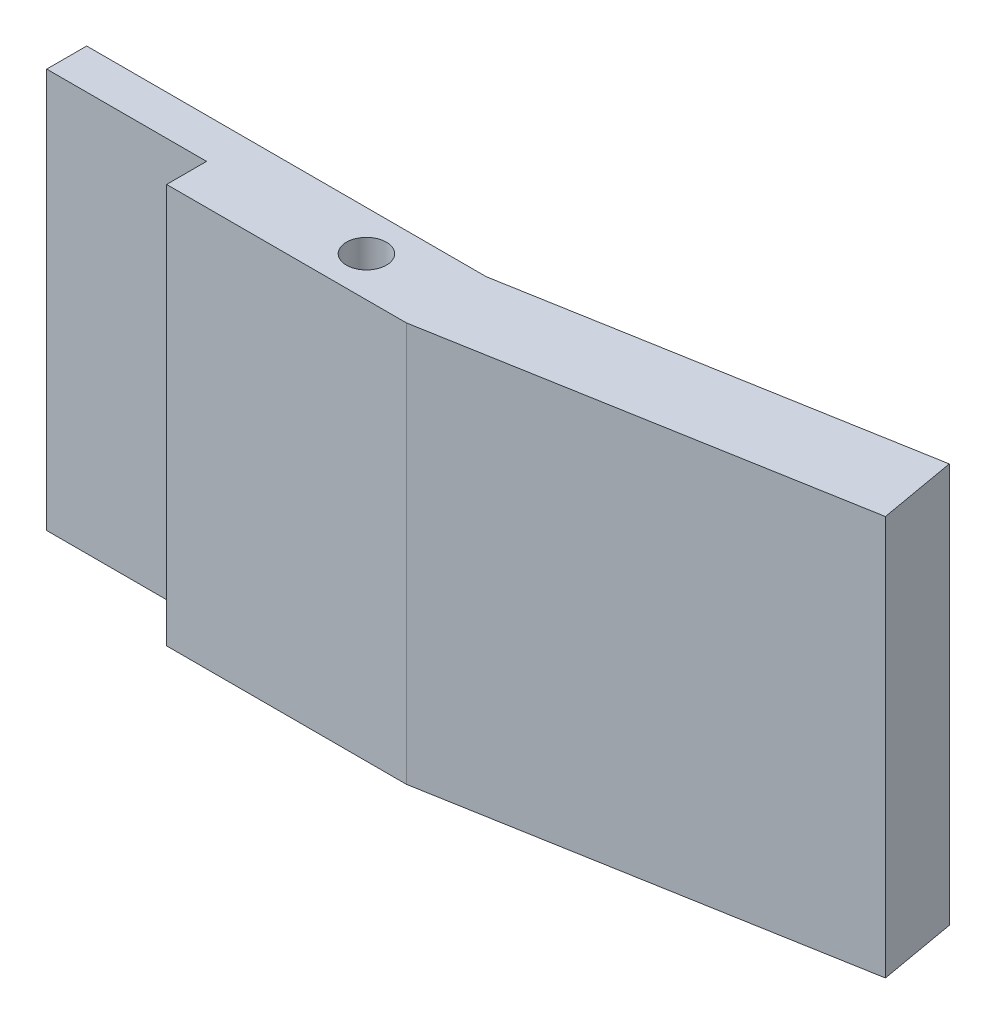
ISO-10303-21;
HEADER;
FILE_DESCRIPTION(('STEP AP214'),'2;1');
FILE_NAME('part.step','',(''),(''),'','','');
FILE_SCHEMA(('AUTOMOTIVE_DESIGN { 1 0 10303 214 1 1 1 1 }'));
ENDSEC;
DATA;
#1=APPLICATION_CONTEXT('core data for automotive mechanical design processes');
#2=APPLICATION_PROTOCOL_DEFINITION('international standard','automotive_design',2000,#1);
#3=PRODUCT_CONTEXT('',#1,'mechanical');
#4=PRODUCT('Part','Part','',(#3));
#5=PRODUCT_RELATED_PRODUCT_CATEGORY('part','',(#4));
#6=PRODUCT_DEFINITION_FORMATION('','',#4);
#7=PRODUCT_DEFINITION_CONTEXT('part definition',#1,'design');
#8=PRODUCT_DEFINITION('design','',#6,#7);
#9=PRODUCT_DEFINITION_SHAPE('','',#8);
#10=(LENGTH_UNIT() NAMED_UNIT(*) SI_UNIT(.MILLI.,.METRE.));
#11=(NAMED_UNIT(*) PLANE_ANGLE_UNIT() SI_UNIT($,.RADIAN.));
#12=(NAMED_UNIT(*) SI_UNIT($,.STERADIAN.) SOLID_ANGLE_UNIT());
#13=UNCERTAINTY_MEASURE_WITH_UNIT(LENGTH_MEASURE(1.E-05),#10,'distance_accuracy_value','');
#14=(GEOMETRIC_REPRESENTATION_CONTEXT(3) GLOBAL_UNCERTAINTY_ASSIGNED_CONTEXT((#13)) GLOBAL_UNIT_ASSIGNED_CONTEXT((#10,
#11,#12)) REPRESENTATION_CONTEXT('',''));
#15=CARTESIAN_POINT('',(0.,0.,0.));
#16=DIRECTION('',(0.,0.,1.));
#17=DIRECTION('',(1.,0.,0.));
#18=AXIS2_PLACEMENT_3D('',#15,#16,#17);
#19=CARTESIAN_POINT('',(25.4,31.75,3.175));
#20=DIRECTION('',(0.,-1.,0.));
#21=DIRECTION('',(0.,0.,-1.));
#22=AXIS2_PLACEMENT_3D('',#19,#20,#21);
#23=CYLINDRICAL_SURFACE('',#22,1.5875);
#24=CARTESIAN_POINT('',(25.4,31.75,3.175));
#25=DIRECTION('',(0.,1.,0.));
#26=DIRECTION('',(0.,0.,1.));
#27=AXIS2_PLACEMENT_3D('',#24,#25,#26);
#28=CIRCLE('',#27,1.5875);
#29=CARTESIAN_POINT('',(25.4,31.75,4.7625));
#30=VERTEX_POINT('',#29);
#31=EDGE_CURVE('E142',#30,#30,#28,.T.);
#32=ORIENTED_EDGE('',*,*,#31,.T.);
#33=EDGE_LOOP('',(#32));
#34=FACE_BOUND('',#33,.T.);
#35=CARTESIAN_POINT('',(25.4,0.,3.175));
#36=DIRECTION('',(0.,1.,0.));
#37=DIRECTION('',(0.,0.,1.));
#38=AXIS2_PLACEMENT_3D('',#35,#36,#37);
#39=CIRCLE('',#38,1.5875);
#40=CARTESIAN_POINT('',(25.4,0.,4.7625));
#41=VERTEX_POINT('',#40);
#42=EDGE_CURVE('E143',#41,#41,#39,.T.);
#43=ORIENTED_EDGE('',*,*,#42,.F.);
#44=EDGE_LOOP('',(#43));
#45=FACE_BOUND('',#44,.T.);
#46=ADVANCED_FACE('F45',(#34,#45),#23,.F.);
#47=CARTESIAN_POINT('',(62.060266513114,31.75,-10.9428994162196));
#48=DIRECTION('',(0.984807753012209,0.,-0.173648177666923));
#49=DIRECTION('',(-0.173648177666923,0.,-0.984807753012209));
#50=AXIS2_PLACEMENT_3D('',#47,#48,#49);
#51=PLANE('',#50);
#52=DIRECTION('',(0.173648177666923,0.,0.984807753012209));
#53=VECTOR('',#52,1.);
#54=CARTESIAN_POINT('',(62.060266513114,0.,-10.9428994162196));
#55=LINE('',#54,#53);
#56=CARTESIAN_POINT('',(63.0176461581377,0.,-5.51332964092484));
#57=VERTEX_POINT('',#56);
#58=CARTESIAN_POINT('',(64.1035601131966,0.,0.645194430070445));
#59=VERTEX_POINT('',#58);
#60=EDGE_CURVE('E157',#57,#59,#55,.T.);
#61=ORIENTED_EDGE('',*,*,#60,.F.);
#62=DIRECTION('',(0.,-1.,0.));
#63=VECTOR('',#62,1.);
#64=CARTESIAN_POINT('',(63.0176461581377,31.75,-5.51332964092484));
#65=LINE('',#64,#63);
#66=CARTESIAN_POINT('',(63.0176461581377,31.75,-5.51332964092484));
#67=VERTEX_POINT('',#66);
#68=EDGE_CURVE('E128',#67,#57,#65,.T.);
#69=ORIENTED_EDGE('',*,*,#68,.F.);
#70=DIRECTION('',(0.173648177666923,0.,0.984807753012209));
#71=VECTOR('',#70,1.);
#72=CARTESIAN_POINT('',(62.060266513114,31.75,-10.9428994162196));
#73=LINE('',#72,#71);
#74=CARTESIAN_POINT('',(64.1035601131966,31.75,0.645194430070445));
#75=VERTEX_POINT('',#74);
#76=EDGE_CURVE('E181',#67,#75,#73,.T.);
#77=ORIENTED_EDGE('',*,*,#76,.T.);
#78=DIRECTION('',(0.,-1.,0.));
#79=VECTOR('',#78,1.);
#80=CARTESIAN_POINT('',(64.1035601131966,31.75,0.645194430070445));
#81=LINE('',#80,#79);
#82=EDGE_CURVE('E55',#75,#59,#81,.T.);
#83=ORIENTED_EDGE('',*,*,#82,.T.);
#84=EDGE_LOOP('',(#61,#69,#77,#83));
#85=FACE_BOUND('',#84,.T.);
#86=ADVANCED_FACE('F207',(#85),#51,.T.);
#87=CARTESIAN_POINT('',(2.04329360008259,31.75,11.5880938462901));
#88=DIRECTION('',(0.173648177666924,0.,0.984807753012209));
#89=DIRECTION('',(0.984807753012209,0.,-0.173648177666924));
#90=AXIS2_PLACEMENT_3D('',#87,#88,#89);
#91=PLANE('',#90);
#92=DIRECTION('',(-0.984807753012209,0.,0.173648177666924));
#93=VECTOR('',#92,1.);
#94=CARTESIAN_POINT('',(2.04329360008259,0.,11.5880938462901));
#95=LINE('',#94,#93);
#96=CARTESIAN_POINT('',(31.75,0.,6.35));
#97=VERTEX_POINT('',#96);
#98=EDGE_CURVE('E104',#59,#97,#95,.T.);
#99=ORIENTED_EDGE('',*,*,#98,.F.);
#100=ORIENTED_EDGE('',*,*,#82,.F.);
#101=DIRECTION('',(-0.984807753012209,0.,0.173648177666924));
#102=VECTOR('',#101,1.);
#103=CARTESIAN_POINT('',(2.04329360008259,31.75,11.5880938462901));
#104=LINE('',#103,#102);
#105=CARTESIAN_POINT('',(31.75,31.75,6.35));
#106=VERTEX_POINT('',#105);
#107=EDGE_CURVE('E147',#75,#106,#104,.T.);
#108=ORIENTED_EDGE('',*,*,#107,.T.);
#109=DIRECTION('',(0.,-1.,0.));
#110=VECTOR('',#109,1.);
#111=CARTESIAN_POINT('',(31.75,31.75,6.35));
#112=LINE('',#111,#110);
#113=EDGE_CURVE('E138',#106,#97,#112,.T.);
#114=ORIENTED_EDGE('',*,*,#113,.T.);
#115=EDGE_LOOP('',(#99,#100,#108,#114));
#116=FACE_BOUND('',#115,.T.);
#117=ADVANCED_FACE('F191',(#116),#91,.T.);
#118=CARTESIAN_POINT('',(0.957379645023635,31.75,5.4295697752948));
#119=DIRECTION('',(-0.173648177666924,0.,-0.984807753012209));
#120=DIRECTION('',(-0.984807753012209,0.,0.173648177666924));
#121=AXIS2_PLACEMENT_3D('',#118,#119,#120);
#122=PLANE('',#121);
#123=DIRECTION('',(0.984807753012209,0.,-0.173648177666924));
#124=VECTOR('',#123,1.);
#125=CARTESIAN_POINT('',(0.957379645023635,0.,5.4295697752948));
#126=LINE('',#125,#124);
#127=CARTESIAN_POINT('',(31.75,0.,0.));
#128=VERTEX_POINT('',#127);
#129=EDGE_CURVE('E99',#128,#57,#126,.T.);
#130=ORIENTED_EDGE('',*,*,#129,.F.);
#131=DIRECTION('',(0.,-1.,0.));
#132=VECTOR('',#131,1.);
#133=CARTESIAN_POINT('',(31.75,31.75,0.));
#134=LINE('',#133,#132);
#135=CARTESIAN_POINT('',(31.75,31.75,0.));
#136=VERTEX_POINT('',#135);
#137=EDGE_CURVE('E93',#136,#128,#134,.T.);
#138=ORIENTED_EDGE('',*,*,#137,.F.);
#139=DIRECTION('',(0.984807753012209,0.,-0.173648177666924));
#140=VECTOR('',#139,1.);
#141=CARTESIAN_POINT('',(0.957379645023635,31.75,5.4295697752948));
#142=LINE('',#141,#140);
#143=EDGE_CURVE('E177',#136,#67,#142,.T.);
#144=ORIENTED_EDGE('',*,*,#143,.T.);
#145=ORIENTED_EDGE('',*,*,#68,.T.);
#146=EDGE_LOOP('',(#130,#138,#144,#145));
#147=FACE_BOUND('',#146,.T.);
#148=ADVANCED_FACE('F212',(#147),#122,.T.);
#149=CARTESIAN_POINT('',(0.,31.75,6.35));
#150=DIRECTION('',(0.,0.,-1.));
#151=DIRECTION('',(-1.,0.,0.));
#152=AXIS2_PLACEMENT_3D('',#149,#150,#151);
#153=PLANE('',#152);
#154=DIRECTION('',(1.,0.,0.));
#155=VECTOR('',#154,1.);
#156=CARTESIAN_POINT('',(0.,0.,6.35));
#157=LINE('',#156,#155);
#158=CARTESIAN_POINT('',(12.7,0.,6.35));
#159=VERTEX_POINT('',#158);
#160=EDGE_CURVE('E148',#159,#97,#157,.T.);
#161=ORIENTED_EDGE('',*,*,#160,.T.);
#162=ORIENTED_EDGE('',*,*,#113,.F.);
#163=DIRECTION('',(1.,0.,0.));
#164=VECTOR('',#163,1.);
#165=CARTESIAN_POINT('',(0.,31.75,6.35));
#166=LINE('',#165,#164);
#167=CARTESIAN_POINT('',(12.7,31.75,6.35));
#168=VERTEX_POINT('',#167);
#169=EDGE_CURVE('E166',#168,#106,#166,.T.);
#170=ORIENTED_EDGE('',*,*,#169,.F.);
#171=DIRECTION('',(0.,-1.,0.));
#172=VECTOR('',#171,1.);
#173=CARTESIAN_POINT('',(12.7,31.75,6.35));
#174=LINE('',#173,#172);
#175=EDGE_CURVE('E134',#168,#159,#174,.T.);
#176=ORIENTED_EDGE('',*,*,#175,.T.);
#177=EDGE_LOOP('',(#161,#162,#170,#176));
#178=FACE_BOUND('',#177,.T.);
#179=ADVANCED_FACE('F224',(#178),#153,.F.);
#180=CARTESIAN_POINT('',(0.,0.,0.));
#181=DIRECTION('',(0.,1.,0.));
#182=DIRECTION('',(0.,0.,1.));
#183=AXIS2_PLACEMENT_3D('',#180,#181,#182);
#184=PLANE('',#183);
#185=ORIENTED_EDGE('',*,*,#98,.T.);
#186=ORIENTED_EDGE('',*,*,#160,.F.);
#187=DIRECTION('',(0.,0.,1.));
#188=VECTOR('',#187,1.);
#189=CARTESIAN_POINT('',(12.7,0.,0.));
#190=LINE('',#189,#188);
#191=CARTESIAN_POINT('',(12.7,0.,3.175));
#192=VERTEX_POINT('',#191);
#193=EDGE_CURVE('E98',#192,#159,#190,.T.);
#194=ORIENTED_EDGE('',*,*,#193,.F.);
#195=DIRECTION('',(1.,0.,0.));
#196=VECTOR('',#195,1.);
#197=CARTESIAN_POINT('',(0.,0.,3.175));
#198=LINE('',#197,#196);
#199=CARTESIAN_POINT('',(0.,0.,3.175));
#200=VERTEX_POINT('',#199);
#201=EDGE_CURVE('E112',#200,#192,#198,.T.);
#202=ORIENTED_EDGE('',*,*,#201,.F.);
#203=DIRECTION('',(0.,0.,1.));
#204=VECTOR('',#203,1.);
#205=CARTESIAN_POINT('',(0.,0.,0.));
#206=LINE('',#205,#204);
#207=CARTESIAN_POINT('',(0.,0.,0.));
#208=VERTEX_POINT('',#207);
#209=EDGE_CURVE('E79',#208,#200,#206,.T.);
#210=ORIENTED_EDGE('',*,*,#209,.F.);
#211=DIRECTION('',(1.,0.,0.));
#212=VECTOR('',#211,1.);
#213=CARTESIAN_POINT('',(0.,0.,0.));
#214=LINE('',#213,#212);
#215=EDGE_CURVE('E86',#208,#128,#214,.T.);
#216=ORIENTED_EDGE('',*,*,#215,.T.);
#217=ORIENTED_EDGE('',*,*,#129,.T.);
#218=ORIENTED_EDGE('',*,*,#60,.T.);
#219=EDGE_LOOP('',(#185,#186,#194,#202,#210,#216,#217,#218));
#220=FACE_BOUND('',#219,.T.);
#221=ORIENTED_EDGE('',*,*,#42,.T.);
#222=EDGE_LOOP('',(#221));
#223=FACE_BOUND('',#222,.T.);
#224=ADVANCED_FACE('F109',(#220,#223),#184,.F.);
#225=CARTESIAN_POINT('',(0.,31.75,0.));
#226=DIRECTION('',(0.,1.,0.));
#227=DIRECTION('',(0.,0.,1.));
#228=AXIS2_PLACEMENT_3D('',#225,#226,#227);
#229=PLANE('',#228);
#230=ORIENTED_EDGE('',*,*,#107,.F.);
#231=ORIENTED_EDGE('',*,*,#76,.F.);
#232=ORIENTED_EDGE('',*,*,#143,.F.);
#233=DIRECTION('',(1.,0.,0.));
#234=VECTOR('',#233,1.);
#235=CARTESIAN_POINT('',(0.,31.75,0.));
#236=LINE('',#235,#234);
#237=CARTESIAN_POINT('',(0.,31.75,0.));
#238=VERTEX_POINT('',#237);
#239=EDGE_CURVE('E174',#238,#136,#236,.T.);
#240=ORIENTED_EDGE('',*,*,#239,.F.);
#241=DIRECTION('',(0.,0.,1.));
#242=VECTOR('',#241,1.);
#243=CARTESIAN_POINT('',(0.,31.75,0.));
#244=LINE('',#243,#242);
#245=CARTESIAN_POINT('',(0.,31.75,3.175));
#246=VERTEX_POINT('',#245);
#247=EDGE_CURVE('E102',#238,#246,#244,.T.);
#248=ORIENTED_EDGE('',*,*,#247,.T.);
#249=DIRECTION('',(1.,0.,0.));
#250=VECTOR('',#249,1.);
#251=CARTESIAN_POINT('',(0.,31.75,3.175));
#252=LINE('',#251,#250);
#253=CARTESIAN_POINT('',(12.7,31.75,3.175));
#254=VERTEX_POINT('',#253);
#255=EDGE_CURVE('E114',#246,#254,#252,.T.);
#256=ORIENTED_EDGE('',*,*,#255,.T.);
#257=DIRECTION('',(0.,0.,1.));
#258=VECTOR('',#257,1.);
#259=CARTESIAN_POINT('',(12.7,31.75,0.));
#260=LINE('',#259,#258);
#261=EDGE_CURVE('E170',#254,#168,#260,.T.);
#262=ORIENTED_EDGE('',*,*,#261,.T.);
#263=ORIENTED_EDGE('',*,*,#169,.T.);
#264=EDGE_LOOP('',(#230,#231,#232,#240,#248,#256,#262,#263));
#265=FACE_BOUND('',#264,.T.);
#266=ORIENTED_EDGE('',*,*,#31,.F.);
#267=EDGE_LOOP('',(#266));
#268=FACE_BOUND('',#267,.T.);
#269=ADVANCED_FACE('F198',(#265,#268),#229,.T.);
#270=CARTESIAN_POINT('',(12.7,31.75,0.));
#271=DIRECTION('',(1.,0.,0.));
#272=DIRECTION('',(0.,0.,-1.));
#273=AXIS2_PLACEMENT_3D('',#270,#271,#272);
#274=PLANE('',#273);
#275=ORIENTED_EDGE('',*,*,#261,.F.);
#276=DIRECTION('',(0.,-1.,0.));
#277=VECTOR('',#276,1.);
#278=CARTESIAN_POINT('',(12.7,31.75,3.175));
#279=LINE('',#278,#277);
#280=EDGE_CURVE('E11',#254,#192,#279,.T.);
#281=ORIENTED_EDGE('',*,*,#280,.T.);
#282=ORIENTED_EDGE('',*,*,#193,.T.);
#283=ORIENTED_EDGE('',*,*,#175,.F.);
#284=EDGE_LOOP('',(#275,#281,#282,#283));
#285=FACE_BOUND('',#284,.T.);
#286=ADVANCED_FACE('F221',(#285),#274,.F.);
#287=CARTESIAN_POINT('',(0.,31.75,0.));
#288=DIRECTION('',(0.,0.,-1.));
#289=DIRECTION('',(-1.,0.,0.));
#290=AXIS2_PLACEMENT_3D('',#287,#288,#289);
#291=PLANE('',#290);
#292=ORIENTED_EDGE('',*,*,#215,.F.);
#293=DIRECTION('',(0.,-1.,0.));
#294=VECTOR('',#293,1.);
#295=CARTESIAN_POINT('',(0.,31.75,0.));
#296=LINE('',#295,#294);
#297=EDGE_CURVE('E89',#238,#208,#296,.T.);
#298=ORIENTED_EDGE('',*,*,#297,.F.);
#299=ORIENTED_EDGE('',*,*,#239,.T.);
#300=ORIENTED_EDGE('',*,*,#137,.T.);
#301=EDGE_LOOP('',(#292,#298,#299,#300));
#302=FACE_BOUND('',#301,.T.);
#303=ADVANCED_FACE('F87',(#302),#291,.T.);
#304=CARTESIAN_POINT('',(0.,31.75,0.));
#305=DIRECTION('',(1.,0.,0.));
#306=DIRECTION('',(0.,0.,-1.));
#307=AXIS2_PLACEMENT_3D('',#304,#305,#306);
#308=PLANE('',#307);
#309=ORIENTED_EDGE('',*,*,#209,.T.);
#310=DIRECTION('',(0.,-1.,0.));
#311=VECTOR('',#310,1.);
#312=CARTESIAN_POINT('',(0.,31.75,3.175));
#313=LINE('',#312,#311);
#314=EDGE_CURVE('E105',#246,#200,#313,.T.);
#315=ORIENTED_EDGE('',*,*,#314,.F.);
#316=ORIENTED_EDGE('',*,*,#247,.F.);
#317=ORIENTED_EDGE('',*,*,#297,.T.);
#318=EDGE_LOOP('',(#309,#315,#316,#317));
#319=FACE_BOUND('',#318,.T.);
#320=ADVANCED_FACE('F101',(#319),#308,.F.);
#321=CARTESIAN_POINT('',(0.,31.75,3.175));
#322=DIRECTION('',(0.,0.,-1.));
#323=DIRECTION('',(-1.,0.,0.));
#324=AXIS2_PLACEMENT_3D('',#321,#322,#323);
#325=PLANE('',#324);
#326=ORIENTED_EDGE('',*,*,#201,.T.);
#327=ORIENTED_EDGE('',*,*,#280,.F.);
#328=ORIENTED_EDGE('',*,*,#255,.F.);
#329=ORIENTED_EDGE('',*,*,#314,.T.);
#330=EDGE_LOOP('',(#326,#327,#328,#329));
#331=FACE_BOUND('',#330,.T.);
#332=ADVANCED_FACE('F47',(#331),#325,.F.);
#333=CLOSED_SHELL('',(#46,#86,#117,#148,#179,#224,#269,#286,#303,#320,#332));
#334=MANIFOLD_SOLID_BREP('B2',#333);
#335=ADVANCED_BREP_SHAPE_REPRESENTATION('',(#18,#334),#14);
#336=SHAPE_DEFINITION_REPRESENTATION(#9,#335);
ENDSEC;
END-ISO-10303-21;
